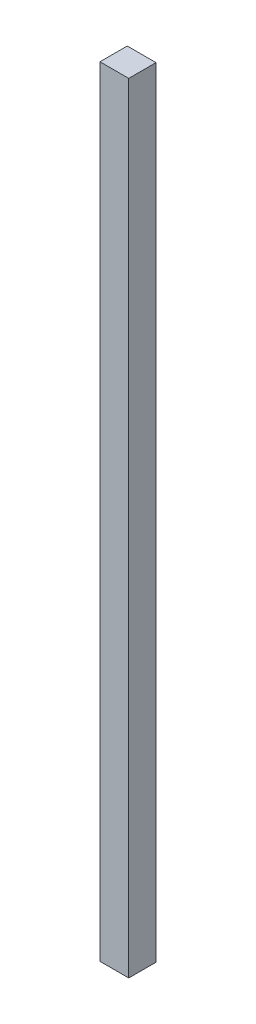
ISO-10303-21;
HEADER;
FILE_DESCRIPTION(('STEP AP214'),'2;1');
FILE_NAME('part.step','',(''),(''),'','','');
FILE_SCHEMA(('AUTOMOTIVE_DESIGN { 1 0 10303 214 1 1 1 1 }'));
ENDSEC;
DATA;
#1=APPLICATION_CONTEXT('core data for automotive mechanical design processes');
#2=APPLICATION_PROTOCOL_DEFINITION('international standard','automotive_design',2000,#1);
#3=PRODUCT_CONTEXT('',#1,'mechanical');
#4=PRODUCT('Part','Part','',(#3));
#5=PRODUCT_RELATED_PRODUCT_CATEGORY('part','',(#4));
#6=PRODUCT_DEFINITION_FORMATION('','',#4);
#7=PRODUCT_DEFINITION_CONTEXT('part definition',#1,'design');
#8=PRODUCT_DEFINITION('design','',#6,#7);
#9=PRODUCT_DEFINITION_SHAPE('','',#8);
#10=(LENGTH_UNIT() NAMED_UNIT(*) SI_UNIT(.MILLI.,.METRE.));
#11=(NAMED_UNIT(*) PLANE_ANGLE_UNIT() SI_UNIT($,.RADIAN.));
#12=(NAMED_UNIT(*) SI_UNIT($,.STERADIAN.) SOLID_ANGLE_UNIT());
#13=UNCERTAINTY_MEASURE_WITH_UNIT(LENGTH_MEASURE(1.E-05),#10,'distance_accuracy_value','');
#14=(GEOMETRIC_REPRESENTATION_CONTEXT(3) GLOBAL_UNCERTAINTY_ASSIGNED_CONTEXT((#13)) GLOBAL_UNIT_ASSIGNED_CONTEXT((#10,
#11,#12)) REPRESENTATION_CONTEXT('',''));
#15=CARTESIAN_POINT('',(0.,0.,0.));
#16=DIRECTION('',(0.,0.,1.));
#17=DIRECTION('',(1.,0.,0.));
#18=AXIS2_PLACEMENT_3D('',#15,#16,#17);
#19=CARTESIAN_POINT('',(-0.2344928,-6.349492,0.44500038));
#20=DIRECTION('',(0.,0.,1.));
#21=DIRECTION('',(1.,0.,0.));
#22=AXIS2_PLACEMENT_3D('',#19,#20,#21);
#23=PLANE('',#22);
#24=DIRECTION('',(-1.,0.,0.));
#25=VECTOR('',#24,1.);
#26=CARTESIAN_POINT('',(0.2344928,-6.349492,0.44500038));
#27=LINE('',#26,#25);
#28=CARTESIAN_POINT('',(0.2344928,-6.349492,0.44500038));
#29=VERTEX_POINT('',#28);
#30=CARTESIAN_POINT('',(-0.2344928,-6.349492,0.44500038));
#31=VERTEX_POINT('',#30);
#32=EDGE_CURVE('E28',#29,#31,#27,.T.);
#33=ORIENTED_EDGE('',*,*,#32,.F.);
#34=DIRECTION('',(0.,-1.,0.));
#35=VECTOR('',#34,1.);
#36=CARTESIAN_POINT('',(0.2344928,6.349492,0.44500038));
#37=LINE('',#36,#35);
#38=CARTESIAN_POINT('',(0.2344928,6.349492,0.44500038));
#39=VERTEX_POINT('',#38);
#40=EDGE_CURVE('E87',#39,#29,#37,.T.);
#41=ORIENTED_EDGE('',*,*,#40,.F.);
#42=DIRECTION('',(1.,0.,0.));
#43=VECTOR('',#42,1.);
#44=CARTESIAN_POINT('',(-0.2344928,6.349492,0.44500038));
#45=LINE('',#44,#43);
#46=CARTESIAN_POINT('',(-0.2344928,6.349492,0.44500038));
#47=VERTEX_POINT('',#46);
#48=EDGE_CURVE('E90',#47,#39,#45,.T.);
#49=ORIENTED_EDGE('',*,*,#48,.F.);
#50=DIRECTION('',(0.,1.,0.));
#51=VECTOR('',#50,1.);
#52=CARTESIAN_POINT('',(-0.2344928,-6.349492,0.44500038));
#53=LINE('',#52,#51);
#54=EDGE_CURVE('E100',#31,#47,#53,.T.);
#55=ORIENTED_EDGE('',*,*,#54,.F.);
#56=EDGE_LOOP('',(#33,#41,#49,#55));
#57=FACE_BOUND('',#56,.T.);
#58=ADVANCED_FACE('F17',(#57),#23,.T.);
#59=CARTESIAN_POINT('',(-0.2344928,-6.349492,0.));
#60=DIRECTION('',(0.,0.,1.));
#61=DIRECTION('',(1.,0.,0.));
#62=AXIS2_PLACEMENT_3D('',#59,#60,#61);
#63=PLANE('',#62);
#64=DIRECTION('',(0.,1.,0.));
#65=VECTOR('',#64,1.);
#66=CARTESIAN_POINT('',(-0.2344928,-6.349492,0.));
#67=LINE('',#66,#65);
#68=CARTESIAN_POINT('',(-0.2344928,-6.349492,0.));
#69=VERTEX_POINT('',#68);
#70=CARTESIAN_POINT('',(-0.2344928,6.349492,0.));
#71=VERTEX_POINT('',#70);
#72=EDGE_CURVE('E21',#69,#71,#67,.T.);
#73=ORIENTED_EDGE('',*,*,#72,.T.);
#74=DIRECTION('',(1.,0.,0.));
#75=VECTOR('',#74,1.);
#76=CARTESIAN_POINT('',(-0.2344928,6.349492,0.));
#77=LINE('',#76,#75);
#78=CARTESIAN_POINT('',(0.2344928,6.349492,0.));
#79=VERTEX_POINT('',#78);
#80=EDGE_CURVE('E80',#71,#79,#77,.T.);
#81=ORIENTED_EDGE('',*,*,#80,.T.);
#82=DIRECTION('',(0.,-1.,0.));
#83=VECTOR('',#82,1.);
#84=CARTESIAN_POINT('',(0.2344928,6.349492,0.));
#85=LINE('',#84,#83);
#86=CARTESIAN_POINT('',(0.2344928,-6.349492,0.));
#87=VERTEX_POINT('',#86);
#88=EDGE_CURVE('E68',#79,#87,#85,.T.);
#89=ORIENTED_EDGE('',*,*,#88,.T.);
#90=DIRECTION('',(-1.,0.,0.));
#91=VECTOR('',#90,1.);
#92=CARTESIAN_POINT('',(0.2344928,-6.349492,0.));
#93=LINE('',#92,#91);
#94=EDGE_CURVE('E11',#87,#69,#93,.T.);
#95=ORIENTED_EDGE('',*,*,#94,.T.);
#96=EDGE_LOOP('',(#73,#81,#89,#95));
#97=FACE_BOUND('',#96,.T.);
#98=ADVANCED_FACE('F81',(#97),#63,.F.);
#99=CARTESIAN_POINT('',(0.2344928,-6.349492,0.));
#100=DIRECTION('',(0.,-1.,0.));
#101=DIRECTION('',(0.,0.,-1.));
#102=AXIS2_PLACEMENT_3D('',#99,#100,#101);
#103=PLANE('',#102);
#104=DIRECTION('',(0.,0.,1.));
#105=VECTOR('',#104,1.);
#106=CARTESIAN_POINT('',(0.2344928,-6.349492,0.));
#107=LINE('',#106,#105);
#108=EDGE_CURVE('E75',#87,#29,#107,.T.);
#109=ORIENTED_EDGE('',*,*,#108,.T.);
#110=ORIENTED_EDGE('',*,*,#32,.T.);
#111=DIRECTION('',(0.,0.,1.));
#112=VECTOR('',#111,1.);
#113=CARTESIAN_POINT('',(-0.2344928,-6.349492,0.));
#114=LINE('',#113,#112);
#115=EDGE_CURVE('E105',#69,#31,#114,.T.);
#116=ORIENTED_EDGE('',*,*,#115,.F.);
#117=ORIENTED_EDGE('',*,*,#94,.F.);
#118=EDGE_LOOP('',(#109,#110,#116,#117));
#119=FACE_BOUND('',#118,.T.);
#120=ADVANCED_FACE('F19',(#119),#103,.T.);
#121=CARTESIAN_POINT('',(0.2344928,6.349492,0.));
#122=DIRECTION('',(1.,0.,0.));
#123=DIRECTION('',(0.,1.,0.));
#124=AXIS2_PLACEMENT_3D('',#121,#122,#123);
#125=PLANE('',#124);
#126=DIRECTION('',(0.,0.,1.));
#127=VECTOR('',#126,1.);
#128=CARTESIAN_POINT('',(0.2344928,6.349492,0.));
#129=LINE('',#128,#127);
#130=EDGE_CURVE('E73',#79,#39,#129,.T.);
#131=ORIENTED_EDGE('',*,*,#130,.T.);
#132=ORIENTED_EDGE('',*,*,#40,.T.);
#133=ORIENTED_EDGE('',*,*,#108,.F.);
#134=ORIENTED_EDGE('',*,*,#88,.F.);
#135=EDGE_LOOP('',(#131,#132,#133,#134));
#136=FACE_BOUND('',#135,.T.);
#137=ADVANCED_FACE('F70',(#136),#125,.T.);
#138=CARTESIAN_POINT('',(-0.2344928,6.349492,0.));
#139=DIRECTION('',(0.,1.,0.));
#140=DIRECTION('',(1.,0.,0.));
#141=AXIS2_PLACEMENT_3D('',#138,#139,#140);
#142=PLANE('',#141);
#143=DIRECTION('',(0.,0.,1.));
#144=VECTOR('',#143,1.);
#145=CARTESIAN_POINT('',(-0.2344928,6.349492,0.));
#146=LINE('',#145,#144);
#147=EDGE_CURVE('E104',#71,#47,#146,.T.);
#148=ORIENTED_EDGE('',*,*,#147,.T.);
#149=ORIENTED_EDGE('',*,*,#48,.T.);
#150=ORIENTED_EDGE('',*,*,#130,.F.);
#151=ORIENTED_EDGE('',*,*,#80,.F.);
#152=EDGE_LOOP('',(#148,#149,#150,#151));
#153=FACE_BOUND('',#152,.T.);
#154=ADVANCED_FACE('F89',(#153),#142,.T.);
#155=CARTESIAN_POINT('',(-0.2344928,-6.349492,0.));
#156=DIRECTION('',(-1.,0.,0.));
#157=DIRECTION('',(0.,0.,1.));
#158=AXIS2_PLACEMENT_3D('',#155,#156,#157);
#159=PLANE('',#158);
#160=ORIENTED_EDGE('',*,*,#115,.T.);
#161=ORIENTED_EDGE('',*,*,#54,.T.);
#162=ORIENTED_EDGE('',*,*,#147,.F.);
#163=ORIENTED_EDGE('',*,*,#72,.F.);
#164=EDGE_LOOP('',(#160,#161,#162,#163));
#165=FACE_BOUND('',#164,.T.);
#166=ADVANCED_FACE('F116',(#165),#159,.T.);
#167=CLOSED_SHELL('',(#58,#98,#120,#137,#154,#166));
#168=MANIFOLD_SOLID_BREP('B1',#167);
#169=ADVANCED_BREP_SHAPE_REPRESENTATION('',(#18,#168),#14);
#170=SHAPE_DEFINITION_REPRESENTATION(#9,#169);
ENDSEC;
END-ISO-10303-21;
